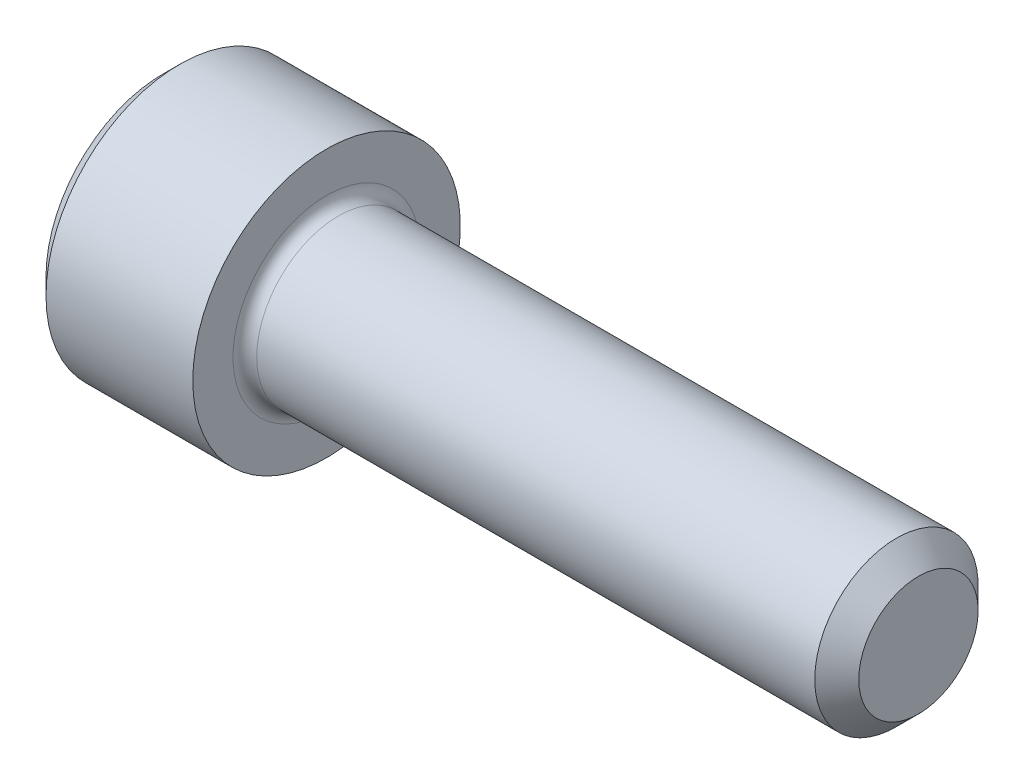
ISO-10303-21;
HEADER;
FILE_DESCRIPTION(('STEP AP214'),'2;1');
FILE_NAME('part.step','',(''),(''),'','','');
FILE_SCHEMA(('AUTOMOTIVE_DESIGN { 1 0 10303 214 1 1 1 1 }'));
ENDSEC;
DATA;
#1=APPLICATION_CONTEXT('core data for automotive mechanical design processes');
#2=APPLICATION_PROTOCOL_DEFINITION('international standard','automotive_design',2000,#1);
#3=PRODUCT_CONTEXT('',#1,'mechanical');
#4=PRODUCT('Part','Part','',(#3));
#5=PRODUCT_RELATED_PRODUCT_CATEGORY('part','',(#4));
#6=PRODUCT_DEFINITION_FORMATION('','',#4);
#7=PRODUCT_DEFINITION_CONTEXT('part definition',#1,'design');
#8=PRODUCT_DEFINITION('design','',#6,#7);
#9=PRODUCT_DEFINITION_SHAPE('','',#8);
#10=(LENGTH_UNIT() NAMED_UNIT(*) SI_UNIT(.MILLI.,.METRE.));
#11=(NAMED_UNIT(*) PLANE_ANGLE_UNIT() SI_UNIT($,.RADIAN.));
#12=(NAMED_UNIT(*) SI_UNIT($,.STERADIAN.) SOLID_ANGLE_UNIT());
#13=UNCERTAINTY_MEASURE_WITH_UNIT(LENGTH_MEASURE(1.E-05),#10,'distance_accuracy_value','');
#14=(GEOMETRIC_REPRESENTATION_CONTEXT(3) GLOBAL_UNCERTAINTY_ASSIGNED_CONTEXT((#13)) GLOBAL_UNIT_ASSIGNED_CONTEXT((#10,
#11,#12)) REPRESENTATION_CONTEXT('',''));
#15=CARTESIAN_POINT('',(0.,0.,0.));
#16=DIRECTION('',(0.,0.,1.));
#17=DIRECTION('',(1.,0.,0.));
#18=AXIS2_PLACEMENT_3D('',#15,#16,#17);
#19=CARTESIAN_POINT('',(0.,0.,0.));
#20=DIRECTION('',(-1.,0.,0.));
#21=DIRECTION('',(0.,0.,1.));
#22=AXIS2_PLACEMENT_3D('',#19,#20,#21);
#23=PLANE('',#22);
#24=DIRECTION('',(0.,-0.499999999999998,0.86602540378444));
#25=VECTOR('',#24,1.);
#26=CARTESIAN_POINT('',(0.,1.5984519552784,0.));
#27=LINE('',#26,#25);
#28=CARTESIAN_POINT('',(0.,1.5984519552784,0.));
#29=VERTEX_POINT('',#28);
#30=CARTESIAN_POINT('',(0.,0.799225977639207,1.3843));
#31=VERTEX_POINT('',#30);
#32=EDGE_CURVE('E387',#29,#31,#27,.T.);
#33=ORIENTED_EDGE('',*,*,#32,.T.);
#34=DIRECTION('',(0.,1.,0.));
#35=VECTOR('',#34,1.);
#36=CARTESIAN_POINT('',(0.,-0.799225977639191,1.3843));
#37=LINE('',#36,#35);
#38=CARTESIAN_POINT('',(0.,-0.799225977639191,1.3843));
#39=VERTEX_POINT('',#38);
#40=EDGE_CURVE('E131',#39,#31,#37,.T.);
#41=ORIENTED_EDGE('',*,*,#40,.F.);
#42=DIRECTION('',(0.,-0.500000000000001,-0.866025403784438));
#43=VECTOR('',#42,1.);
#44=CARTESIAN_POINT('',(0.,-0.799225977639191,1.3843));
#45=LINE('',#44,#43);
#46=CARTESIAN_POINT('',(0.,-1.59845195527839,0.));
#47=VERTEX_POINT('',#46);
#48=EDGE_CURVE('E390',#39,#47,#45,.T.);
#49=ORIENTED_EDGE('',*,*,#48,.T.);
#50=DIRECTION('',(0.,0.499999999999998,-0.86602540378444));
#51=VECTOR('',#50,1.);
#52=CARTESIAN_POINT('',(0.,-1.59845195527839,0.));
#53=LINE('',#52,#51);
#54=CARTESIAN_POINT('',(0.,-0.799225977639196,-1.3843));
#55=VERTEX_POINT('',#54);
#56=EDGE_CURVE('E393',#47,#55,#53,.T.);
#57=ORIENTED_EDGE('',*,*,#56,.T.);
#58=DIRECTION('',(0.,-1.,0.));
#59=VECTOR('',#58,1.);
#60=CARTESIAN_POINT('',(0.,0.799225977639202,-1.3843));
#61=LINE('',#60,#59);
#62=CARTESIAN_POINT('',(0.,0.799225977639202,-1.3843));
#63=VERTEX_POINT('',#62);
#64=EDGE_CURVE('E396',#63,#55,#61,.T.);
#65=ORIENTED_EDGE('',*,*,#64,.F.);
#66=DIRECTION('',(0.,-0.500000000000001,-0.866025403784438));
#67=VECTOR('',#66,1.);
#68=CARTESIAN_POINT('',(0.,1.5984519552784,0.));
#69=LINE('',#68,#67);
#70=EDGE_CURVE('E126',#29,#63,#69,.T.);
#71=ORIENTED_EDGE('',*,*,#70,.F.);
#72=EDGE_LOOP('',(#33,#41,#49,#57,#65,#71));
#73=FACE_BOUND('',#72,.T.);
#74=CARTESIAN_POINT('',(0.,0.,0.));
#75=DIRECTION('',(-1.,0.,0.));
#76=DIRECTION('',(0.,0.,1.));
#77=AXIS2_PLACEMENT_3D('',#74,#75,#76);
#78=CIRCLE('',#77,2.5146);
#79=CARTESIAN_POINT('',(0.,0.,2.5146));
#80=VERTEX_POINT('',#79);
#81=EDGE_CURVE('E142',#80,#80,#78,.T.);
#82=ORIENTED_EDGE('',*,*,#81,.T.);
#83=EDGE_LOOP('',(#82));
#84=FACE_BOUND('',#83,.T.);
#85=ADVANCED_FACE('F35',(#73,#84),#23,.T.);
#86=CARTESIAN_POINT('',(16.2052,1.28016,0.));
#87=DIRECTION('',(1.,0.,0.));
#88=DIRECTION('',(0.,0.,-1.));
#89=AXIS2_PLACEMENT_3D('',#86,#87,#88);
#90=PLANE('',#89);
#91=CARTESIAN_POINT('',(16.2052,0.,0.));
#92=DIRECTION('',(-1.,0.,0.));
#93=DIRECTION('',(0.,0.,1.));
#94=AXIS2_PLACEMENT_3D('',#91,#92,#93);
#95=CIRCLE('',#94,1.28016);
#96=CARTESIAN_POINT('',(16.2052,0.,1.28016));
#97=VERTEX_POINT('',#96);
#98=EDGE_CURVE('E155',#97,#97,#95,.T.);
#99=ORIENTED_EDGE('',*,*,#98,.F.);
#100=EDGE_LOOP('',(#99));
#101=FACE_BOUND('',#100,.T.);
#102=ADVANCED_FACE('F176',(#101),#90,.T.);
#103=CARTESIAN_POINT('',(16.2052,0.,0.));
#104=DIRECTION('',(-1.,0.,0.));
#105=DIRECTION('',(0.,0.,1.));
#106=AXIS2_PLACEMENT_3D('',#103,#104,#105);
#107=CONICAL_SURFACE('',#106,1.28016,0.785398163397443);
#108=CARTESIAN_POINT('',(15.73276,0.,0.));
#109=DIRECTION('',(-1.,0.,0.));
#110=DIRECTION('',(0.,0.,1.));
#111=AXIS2_PLACEMENT_3D('',#108,#109,#110);
#112=CIRCLE('',#111,1.7526);
#113=CARTESIAN_POINT('',(15.73276,0.,1.7526));
#114=VERTEX_POINT('',#113);
#115=EDGE_CURVE('E152',#114,#114,#112,.T.);
#116=ORIENTED_EDGE('',*,*,#115,.F.);
#117=EDGE_LOOP('',(#116));
#118=FACE_BOUND('',#117,.T.);
#119=ORIENTED_EDGE('',*,*,#98,.T.);
#120=EDGE_LOOP('',(#119));
#121=FACE_BOUND('',#120,.T.);
#122=ADVANCED_FACE('F182',(#118,#121),#107,.T.);
#123=CARTESIAN_POINT('',(-31.75,0.,0.));
#124=DIRECTION('',(-1.,0.,0.));
#125=DIRECTION('',(0.,0.,1.));
#126=AXIS2_PLACEMENT_3D('',#123,#124,#125);
#127=CYLINDRICAL_SURFACE('',#126,1.7526);
#128=CARTESIAN_POINT('',(3.7592,0.,0.));
#129=DIRECTION('',(1.,0.,0.));
#130=DIRECTION('',(0.,0.,-1.));
#131=AXIS2_PLACEMENT_3D('',#128,#129,#130);
#132=CIRCLE('',#131,1.7526);
#133=CARTESIAN_POINT('',(3.7592,0.,-1.7526));
#134=VERTEX_POINT('',#133);
#135=EDGE_CURVE('E11',#134,#134,#132,.T.);
#136=ORIENTED_EDGE('',*,*,#135,.T.);
#137=EDGE_LOOP('',(#136));
#138=FACE_BOUND('',#137,.T.);
#139=ORIENTED_EDGE('',*,*,#115,.T.);
#140=EDGE_LOOP('',(#139));
#141=FACE_BOUND('',#140,.T.);
#142=ADVANCED_FACE('F193',(#138,#141),#127,.T.);
#143=CARTESIAN_POINT('',(3.5052,2.8702,0.));
#144=DIRECTION('',(1.,0.,0.));
#145=DIRECTION('',(0.,0.,-1.));
#146=AXIS2_PLACEMENT_3D('',#143,#144,#145);
#147=PLANE('',#146);
#148=CARTESIAN_POINT('',(3.5052,0.,0.));
#149=DIRECTION('',(1.,0.,0.));
#150=DIRECTION('',(0.,0.,-1.));
#151=AXIS2_PLACEMENT_3D('',#148,#149,#150);
#152=CIRCLE('',#151,2.0066);
#153=CARTESIAN_POINT('',(3.5052,0.,-2.0066));
#154=VERTEX_POINT('',#153);
#155=EDGE_CURVE('E43',#154,#154,#152,.F.);
#156=ORIENTED_EDGE('',*,*,#155,.T.);
#157=EDGE_LOOP('',(#156));
#158=FACE_BOUND('',#157,.T.);
#159=CARTESIAN_POINT('',(3.5052,0.,0.));
#160=DIRECTION('',(-1.,0.,0.));
#161=DIRECTION('',(0.,0.,1.));
#162=AXIS2_PLACEMENT_3D('',#159,#160,#161);
#163=CIRCLE('',#162,2.8702);
#164=CARTESIAN_POINT('',(3.5052,0.,2.8702));
#165=VERTEX_POINT('',#164);
#166=EDGE_CURVE('E149',#165,#165,#163,.T.);
#167=ORIENTED_EDGE('',*,*,#166,.F.);
#168=EDGE_LOOP('',(#167));
#169=FACE_BOUND('',#168,.T.);
#170=ADVANCED_FACE('F160',(#158,#169),#147,.T.);
#171=CARTESIAN_POINT('',(-31.75,0.,0.));
#172=DIRECTION('',(-1.,0.,0.));
#173=DIRECTION('',(0.,0.,1.));
#174=AXIS2_PLACEMENT_3D('',#171,#172,#173);
#175=CYLINDRICAL_SURFACE('',#174,2.8702);
#176=ORIENTED_EDGE('',*,*,#166,.T.);
#177=EDGE_LOOP('',(#176));
#178=FACE_BOUND('',#177,.T.);
#179=CARTESIAN_POINT('',(0.355599999999998,0.,0.));
#180=DIRECTION('',(-1.,0.,0.));
#181=DIRECTION('',(0.,0.,1.));
#182=AXIS2_PLACEMENT_3D('',#179,#180,#181);
#183=CIRCLE('',#182,2.8702);
#184=CARTESIAN_POINT('',(0.355599999999998,0.,2.8702));
#185=VERTEX_POINT('',#184);
#186=EDGE_CURVE('E146',#185,#185,#183,.T.);
#187=ORIENTED_EDGE('',*,*,#186,.F.);
#188=EDGE_LOOP('',(#187));
#189=FACE_BOUND('',#188,.T.);
#190=ADVANCED_FACE('F171',(#178,#189),#175,.T.);
#191=CARTESIAN_POINT('',(0.,0.,0.));
#192=DIRECTION('',(1.,0.,0.));
#193=DIRECTION('',(0.,0.,-1.));
#194=AXIS2_PLACEMENT_3D('',#191,#192,#193);
#195=CONICAL_SURFACE('',#194,2.5146,0.785398163397454);
#196=ORIENTED_EDGE('',*,*,#186,.T.);
#197=EDGE_LOOP('',(#196));
#198=FACE_BOUND('',#197,.T.);
#199=ORIENTED_EDGE('',*,*,#81,.F.);
#200=EDGE_LOOP('',(#199));
#201=FACE_BOUND('',#200,.T.);
#202=ADVANCED_FACE('F164',(#198,#201),#195,.T.);
#203=CARTESIAN_POINT('',(3.7592,0.,0.));
#204=DIRECTION('',(1.,0.,0.));
#205=DIRECTION('',(0.,0.,-1.));
#206=AXIS2_PLACEMENT_3D('',#203,#204,#205);
#207=TOROIDAL_SURFACE('',#206,2.0066,0.254);
#208=ORIENTED_EDGE('',*,*,#135,.F.);
#209=EDGE_LOOP('',(#208));
#210=FACE_BOUND('',#209,.T.);
#211=ORIENTED_EDGE('',*,*,#155,.F.);
#212=EDGE_LOOP('',(#211));
#213=FACE_BOUND('',#212,.T.);
#214=ADVANCED_FACE('F37',(#210,#213),#207,.F.);
#215=CARTESIAN_POINT('',(1.6256,1.5984519552784,0.));
#216=DIRECTION('',(0.,-0.86602540378444,-0.499999999999998));
#217=DIRECTION('',(0.,0.499999999999998,-0.86602540378444));
#218=AXIS2_PLACEMENT_3D('',#215,#216,#217);
#219=PLANE('',#218);
#220=ORIENTED_EDGE('',*,*,#32,.F.);
#221=DIRECTION('',(-1.,0.,0.));
#222=VECTOR('',#221,1.);
#223=CARTESIAN_POINT('',(1.6256,1.5984519552784,0.));
#224=LINE('',#223,#222);
#225=CARTESIAN_POINT('',(1.6256,1.5984519552784,0.));
#226=VERTEX_POINT('',#225);
#227=EDGE_CURVE('E377',#226,#29,#224,.T.);
#228=ORIENTED_EDGE('',*,*,#227,.F.);
#229=DIRECTION('',(0.,-0.499999999999998,0.86602540378444));
#230=VECTOR('',#229,1.);
#231=CARTESIAN_POINT('',(1.6256,1.5984519552784,0.));
#232=LINE('',#231,#230);
#233=CARTESIAN_POINT('',(1.6256,1.1988389664588,0.692149999999999));
#234=VERTEX_POINT('',#233);
#235=EDGE_CURVE('E118',#226,#234,#232,.T.);
#236=ORIENTED_EDGE('',*,*,#235,.T.);
#237=CARTESIAN_POINT('',(1.6256,0.799225977639207,1.3843));
#238=VERTEX_POINT('',#237);
#239=EDGE_CURVE('E109',#234,#238,#232,.T.);
#240=ORIENTED_EDGE('',*,*,#239,.T.);
#241=DIRECTION('',(-1.,0.,0.));
#242=VECTOR('',#241,1.);
#243=CARTESIAN_POINT('',(1.6256,0.799225977639207,1.3843));
#244=LINE('',#243,#242);
#245=EDGE_CURVE('E123',#238,#31,#244,.T.);
#246=ORIENTED_EDGE('',*,*,#245,.T.);
#247=EDGE_LOOP('',(#220,#228,#236,#240,#246));
#248=FACE_BOUND('',#247,.T.);
#249=ADVANCED_FACE('F122',(#248),#219,.T.);
#250=CARTESIAN_POINT('',(1.6256,-0.799225977639191,1.3843));
#251=DIRECTION('',(0.,0.,1.));
#252=DIRECTION('',(0.,-1.,0.));
#253=AXIS2_PLACEMENT_3D('',#250,#251,#252);
#254=PLANE('',#253);
#255=ORIENTED_EDGE('',*,*,#40,.T.);
#256=ORIENTED_EDGE('',*,*,#245,.F.);
#257=DIRECTION('',(0.,1.,0.));
#258=VECTOR('',#257,1.);
#259=CARTESIAN_POINT('',(1.6256,-0.799225977639191,1.3843));
#260=LINE('',#259,#258);
#261=CARTESIAN_POINT('',(1.6256,0.,1.3843));
#262=VERTEX_POINT('',#261);
#263=EDGE_CURVE('E106',#262,#238,#260,.T.);
#264=ORIENTED_EDGE('',*,*,#263,.F.);
#265=CARTESIAN_POINT('',(1.6256,-0.799225977639191,1.3843));
#266=VERTEX_POINT('',#265);
#267=EDGE_CURVE('E117',#266,#262,#260,.T.);
#268=ORIENTED_EDGE('',*,*,#267,.F.);
#269=DIRECTION('',(-1.,0.,0.));
#270=VECTOR('',#269,1.);
#271=CARTESIAN_POINT('',(1.6256,-0.799225977639191,1.3843));
#272=LINE('',#271,#270);
#273=EDGE_CURVE('E133',#266,#39,#272,.T.);
#274=ORIENTED_EDGE('',*,*,#273,.T.);
#275=EDGE_LOOP('',(#255,#256,#264,#268,#274));
#276=FACE_BOUND('',#275,.T.);
#277=ADVANCED_FACE('F128',(#276),#254,.F.);
#278=CARTESIAN_POINT('',(1.6256,-0.799225977639191,1.3843));
#279=DIRECTION('',(0.,0.866025403784438,-0.500000000000001));
#280=DIRECTION('',(0.,0.500000000000001,0.866025403784438));
#281=AXIS2_PLACEMENT_3D('',#278,#279,#280);
#282=PLANE('',#281);
#283=ORIENTED_EDGE('',*,*,#48,.F.);
#284=ORIENTED_EDGE('',*,*,#273,.F.);
#285=DIRECTION('',(0.,-0.500000000000001,-0.866025403784438));
#286=VECTOR('',#285,1.);
#287=CARTESIAN_POINT('',(1.6256,-0.799225977639191,1.3843));
#288=LINE('',#287,#286);
#289=CARTESIAN_POINT('',(1.6256,-1.19883896645879,0.692149999999998));
#290=VERTEX_POINT('',#289);
#291=EDGE_CURVE('E416',#266,#290,#288,.T.);
#292=ORIENTED_EDGE('',*,*,#291,.T.);
#293=CARTESIAN_POINT('',(1.6256,-1.59845195527839,0.));
#294=VERTEX_POINT('',#293);
#295=EDGE_CURVE('E405',#290,#294,#288,.T.);
#296=ORIENTED_EDGE('',*,*,#295,.T.);
#297=DIRECTION('',(-1.,0.,0.));
#298=VECTOR('',#297,1.);
#299=CARTESIAN_POINT('',(1.6256,-1.59845195527839,0.));
#300=LINE('',#299,#298);
#301=EDGE_CURVE('E138',#294,#47,#300,.T.);
#302=ORIENTED_EDGE('',*,*,#301,.T.);
#303=EDGE_LOOP('',(#283,#284,#292,#296,#302));
#304=FACE_BOUND('',#303,.T.);
#305=ADVANCED_FACE('F268',(#304),#282,.T.);
#306=CARTESIAN_POINT('',(1.6256,-1.59845195527839,0.));
#307=DIRECTION('',(0.,0.86602540378444,0.499999999999998));
#308=DIRECTION('',(0.,-0.499999999999998,0.86602540378444));
#309=AXIS2_PLACEMENT_3D('',#306,#307,#308);
#310=PLANE('',#309);
#311=ORIENTED_EDGE('',*,*,#56,.F.);
#312=ORIENTED_EDGE('',*,*,#301,.F.);
#313=DIRECTION('',(0.,0.499999999999998,-0.86602540378444));
#314=VECTOR('',#313,1.);
#315=CARTESIAN_POINT('',(1.6256,-1.59845195527839,0.));
#316=LINE('',#315,#314);
#317=CARTESIAN_POINT('',(1.6256,-1.1988389664588,-0.692149999999996));
#318=VERTEX_POINT('',#317);
#319=EDGE_CURVE('E383',#294,#318,#316,.T.);
#320=ORIENTED_EDGE('',*,*,#319,.T.);
#321=CARTESIAN_POINT('',(1.6256,-0.799225977639196,-1.3843));
#322=VERTEX_POINT('',#321);
#323=EDGE_CURVE('E415',#318,#322,#316,.T.);
#324=ORIENTED_EDGE('',*,*,#323,.T.);
#325=DIRECTION('',(-1.,0.,0.));
#326=VECTOR('',#325,1.);
#327=CARTESIAN_POINT('',(1.6256,-0.799225977639196,-1.3843));
#328=LINE('',#327,#326);
#329=EDGE_CURVE('E376',#322,#55,#328,.T.);
#330=ORIENTED_EDGE('',*,*,#329,.T.);
#331=EDGE_LOOP('',(#311,#312,#320,#324,#330));
#332=FACE_BOUND('',#331,.T.);
#333=ADVANCED_FACE('F276',(#332),#310,.T.);
#334=CARTESIAN_POINT('',(1.6256,0.799225977639202,-1.3843));
#335=DIRECTION('',(0.,0.,-1.));
#336=DIRECTION('',(0.,1.,0.));
#337=AXIS2_PLACEMENT_3D('',#334,#335,#336);
#338=PLANE('',#337);
#339=ORIENTED_EDGE('',*,*,#64,.T.);
#340=ORIENTED_EDGE('',*,*,#329,.F.);
#341=DIRECTION('',(0.,-1.,0.));
#342=VECTOR('',#341,1.);
#343=CARTESIAN_POINT('',(1.6256,0.799225977639202,-1.3843));
#344=LINE('',#343,#342);
#345=CARTESIAN_POINT('',(1.6256,0.,-1.3843));
#346=VERTEX_POINT('',#345);
#347=EDGE_CURVE('E380',#346,#322,#344,.T.);
#348=ORIENTED_EDGE('',*,*,#347,.F.);
#349=CARTESIAN_POINT('',(1.6256,0.799225977639202,-1.3843));
#350=VERTEX_POINT('',#349);
#351=EDGE_CURVE('E50',#350,#346,#344,.T.);
#352=ORIENTED_EDGE('',*,*,#351,.F.);
#353=DIRECTION('',(-1.,0.,0.));
#354=VECTOR('',#353,1.);
#355=CARTESIAN_POINT('',(1.6256,0.799225977639202,-1.3843));
#356=LINE('',#355,#354);
#357=EDGE_CURVE('E373',#350,#63,#356,.T.);
#358=ORIENTED_EDGE('',*,*,#357,.T.);
#359=EDGE_LOOP('',(#339,#340,#348,#352,#358));
#360=FACE_BOUND('',#359,.T.);
#361=ADVANCED_FACE('F285',(#360),#338,.F.);
#362=CARTESIAN_POINT('',(1.6256,1.5984519552784,0.));
#363=DIRECTION('',(0.,0.866025403784438,-0.500000000000001));
#364=DIRECTION('',(0.,0.500000000000001,0.866025403784438));
#365=AXIS2_PLACEMENT_3D('',#362,#363,#364);
#366=PLANE('',#365);
#367=ORIENTED_EDGE('',*,*,#70,.T.);
#368=ORIENTED_EDGE('',*,*,#357,.F.);
#369=DIRECTION('',(0.,-0.500000000000001,-0.866025403784438));
#370=VECTOR('',#369,1.);
#371=CARTESIAN_POINT('',(1.6256,1.5984519552784,0.));
#372=LINE('',#371,#370);
#373=CARTESIAN_POINT('',(1.6256,1.1988389664588,-0.692150000000004));
#374=VERTEX_POINT('',#373);
#375=EDGE_CURVE('E363',#374,#350,#372,.T.);
#376=ORIENTED_EDGE('',*,*,#375,.F.);
#377=EDGE_CURVE('E369',#226,#374,#372,.T.);
#378=ORIENTED_EDGE('',*,*,#377,.F.);
#379=ORIENTED_EDGE('',*,*,#227,.T.);
#380=EDGE_LOOP('',(#367,#368,#376,#378,#379));
#381=FACE_BOUND('',#380,.T.);
#382=ADVANCED_FACE('F294',(#381),#366,.F.);
#383=CARTESIAN_POINT('',(1.6256,2.3976779329176,-1.3843));
#384=DIRECTION('',(1.,0.,0.));
#385=DIRECTION('',(0.,0.,-1.));
#386=AXIS2_PLACEMENT_3D('',#383,#384,#385);
#387=PLANE('',#386);
#388=ORIENTED_EDGE('',*,*,#347,.T.);
#389=ORIENTED_EDGE('',*,*,#323,.F.);
#390=CARTESIAN_POINT('',(1.6256,0.,0.));
#391=DIRECTION('',(-1.,0.,0.));
#392=DIRECTION('',(0.,0.,1.));
#393=AXIS2_PLACEMENT_3D('',#390,#391,#392);
#394=CIRCLE('',#393,1.3843);
#395=EDGE_CURVE('E411',#346,#318,#394,.T.);
#396=ORIENTED_EDGE('',*,*,#395,.F.);
#397=EDGE_LOOP('',(#388,#389,#396));
#398=FACE_BOUND('',#397,.T.);
#399=ADVANCED_FACE('F303',(#398),#387,.F.);
#400=ORIENTED_EDGE('',*,*,#319,.F.);
#401=ORIENTED_EDGE('',*,*,#295,.F.);
#402=EDGE_CURVE('E136',#318,#290,#394,.T.);
#403=ORIENTED_EDGE('',*,*,#402,.F.);
#404=EDGE_LOOP('',(#400,#401,#403));
#405=FACE_BOUND('',#404,.T.);
#406=ADVANCED_FACE('F312',(#405),#387,.F.);
#407=ORIENTED_EDGE('',*,*,#291,.F.);
#408=ORIENTED_EDGE('',*,*,#267,.T.);
#409=EDGE_CURVE('E132',#290,#262,#394,.T.);
#410=ORIENTED_EDGE('',*,*,#409,.F.);
#411=EDGE_LOOP('',(#407,#408,#410));
#412=FACE_BOUND('',#411,.T.);
#413=ADVANCED_FACE('F321',(#412),#387,.F.);
#414=ORIENTED_EDGE('',*,*,#263,.T.);
#415=ORIENTED_EDGE('',*,*,#239,.F.);
#416=EDGE_CURVE('E112',#262,#234,#394,.T.);
#417=ORIENTED_EDGE('',*,*,#416,.F.);
#418=EDGE_LOOP('',(#414,#415,#417));
#419=FACE_BOUND('',#418,.T.);
#420=ADVANCED_FACE('F108',(#419),#387,.F.);
#421=ORIENTED_EDGE('',*,*,#235,.F.);
#422=ORIENTED_EDGE('',*,*,#377,.T.);
#423=EDGE_CURVE('E143',#234,#374,#394,.T.);
#424=ORIENTED_EDGE('',*,*,#423,.F.);
#425=EDGE_LOOP('',(#421,#422,#424));
#426=FACE_BOUND('',#425,.T.);
#427=ADVANCED_FACE('F336',(#426),#387,.F.);
#428=ORIENTED_EDGE('',*,*,#375,.T.);
#429=ORIENTED_EDGE('',*,*,#351,.T.);
#430=EDGE_CURVE('E366',#374,#346,#394,.T.);
#431=ORIENTED_EDGE('',*,*,#430,.F.);
#432=EDGE_LOOP('',(#428,#429,#431));
#433=FACE_BOUND('',#432,.T.);
#434=ADVANCED_FACE('F251',(#433),#387,.F.);
#435=CARTESIAN_POINT('',(1.6256,0.,0.));
#436=DIRECTION('',(-1.,0.,0.));
#437=DIRECTION('',(0.,0.,1.));
#438=AXIS2_PLACEMENT_3D('',#435,#436,#437);
#439=CONICAL_SURFACE('',#438,1.3843,1.04719755119659);
#440=CARTESIAN_POINT('',(2.4248259776392,0.,0.));
#441=VERTEX_POINT('',#440);
#442=VERTEX_LOOP('',#441);
#443=FACE_BOUND('',#442,.T.);
#444=ORIENTED_EDGE('',*,*,#416,.T.);
#445=ORIENTED_EDGE('',*,*,#423,.T.);
#446=ORIENTED_EDGE('',*,*,#430,.T.);
#447=ORIENTED_EDGE('',*,*,#395,.T.);
#448=ORIENTED_EDGE('',*,*,#402,.T.);
#449=ORIENTED_EDGE('',*,*,#409,.T.);
#450=EDGE_LOOP('',(#444,#445,#446,#447,#448,#449));
#451=FACE_BOUND('',#450,.T.);
#452=ADVANCED_FACE('F186',(#443,#451),#439,.F.);
#453=CLOSED_SHELL('',(#85,#102,#122,#142,#170,#190,#202,#214,#249,#277,#305,#333,#361,#382,#399,
#406,#413,#420,#427,#434,#452));
#454=MANIFOLD_SOLID_BREP('B2',#453);
#455=ADVANCED_BREP_SHAPE_REPRESENTATION('',(#18,#454),#14);
#456=SHAPE_DEFINITION_REPRESENTATION(#9,#455);
ENDSEC;
END-ISO-10303-21;
